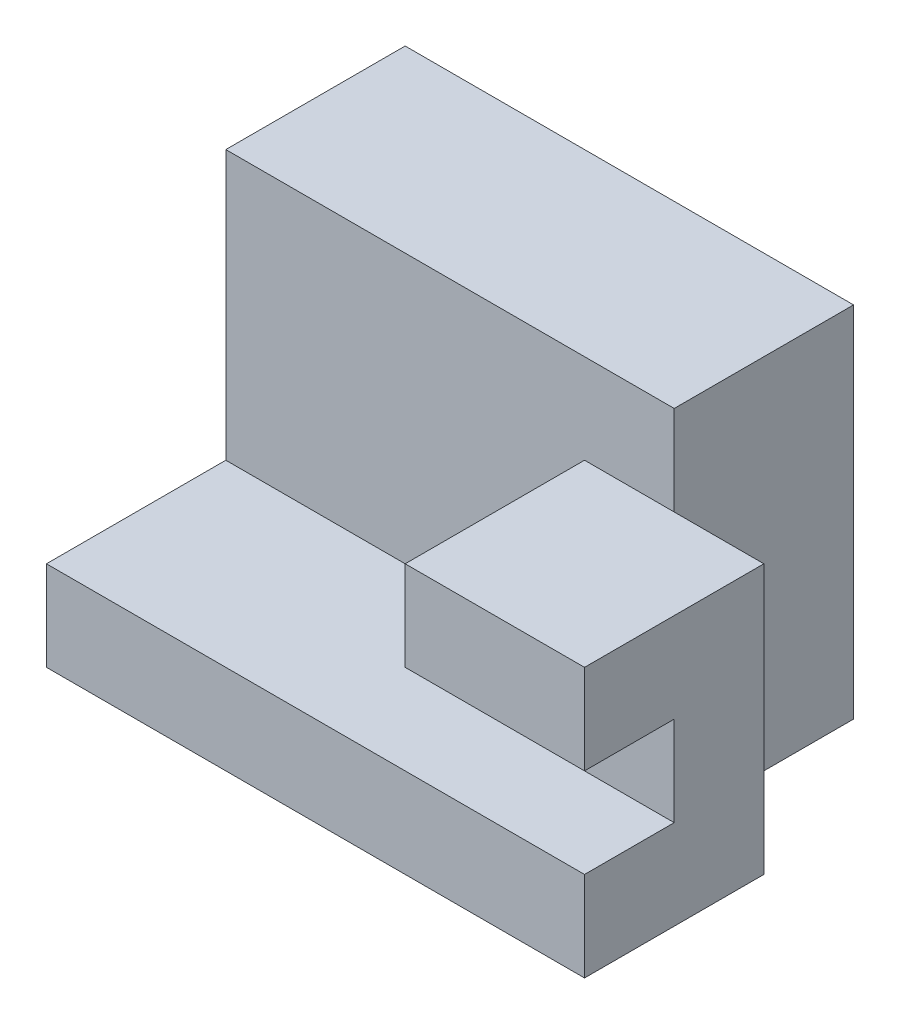
ISO-10303-21;
HEADER;
FILE_DESCRIPTION(('STEP AP214'),'2;1');
FILE_NAME('part.step','',(''),(''),'','','');
FILE_SCHEMA(('AUTOMOTIVE_DESIGN { 1 0 10303 214 1 1 1 1 }'));
ENDSEC;
DATA;
#1=APPLICATION_CONTEXT('core data for automotive mechanical design processes');
#2=APPLICATION_PROTOCOL_DEFINITION('international standard','automotive_design',2000,#1);
#3=PRODUCT_CONTEXT('',#1,'mechanical');
#4=PRODUCT('Part','Part','',(#3));
#5=PRODUCT_RELATED_PRODUCT_CATEGORY('part','',(#4));
#6=PRODUCT_DEFINITION_FORMATION('','',#4);
#7=PRODUCT_DEFINITION_CONTEXT('part definition',#1,'design');
#8=PRODUCT_DEFINITION('design','',#6,#7);
#9=PRODUCT_DEFINITION_SHAPE('','',#8);
#10=(LENGTH_UNIT() NAMED_UNIT(*) SI_UNIT(.MILLI.,.METRE.));
#11=(NAMED_UNIT(*) PLANE_ANGLE_UNIT() SI_UNIT($,.RADIAN.));
#12=(NAMED_UNIT(*) SI_UNIT($,.STERADIAN.) SOLID_ANGLE_UNIT());
#13=UNCERTAINTY_MEASURE_WITH_UNIT(LENGTH_MEASURE(1.E-05),#10,'distance_accuracy_value','');
#14=(GEOMETRIC_REPRESENTATION_CONTEXT(3) GLOBAL_UNCERTAINTY_ASSIGNED_CONTEXT((#13)) GLOBAL_UNIT_ASSIGNED_CONTEXT((#10,
#11,#12)) REPRESENTATION_CONTEXT('',''));
#15=CARTESIAN_POINT('',(0.,0.,0.));
#16=DIRECTION('',(0.,0.,1.));
#17=DIRECTION('',(1.,0.,0.));
#18=AXIS2_PLACEMENT_3D('',#15,#16,#17);
#19=CARTESIAN_POINT('',(0.,20.,0.));
#20=DIRECTION('',(0.,0.,1.));
#21=DIRECTION('',(1.,0.,0.));
#22=AXIS2_PLACEMENT_3D('',#19,#20,#21);
#23=PLANE('',#22);
#24=DIRECTION('',(0.,-1.,0.));
#25=VECTOR('',#24,1.);
#26=CARTESIAN_POINT('',(20.,0.,0.));
#27=LINE('',#26,#25);
#28=CARTESIAN_POINT('',(20.,15.,0.));
#29=VERTEX_POINT('',#28);
#30=CARTESIAN_POINT('',(20.,5.,0.));
#31=VERTEX_POINT('',#30);
#32=EDGE_CURVE('E50',#29,#31,#27,.T.);
#33=ORIENTED_EDGE('',*,*,#32,.F.);
#34=DIRECTION('',(1.,0.,0.));
#35=VECTOR('',#34,1.);
#36=CARTESIAN_POINT('',(20.,15.,0.));
#37=LINE('',#36,#35);
#38=CARTESIAN_POINT('',(25.,15.,0.));
#39=VERTEX_POINT('',#38);
#40=EDGE_CURVE('E149',#29,#39,#37,.T.);
#41=ORIENTED_EDGE('',*,*,#40,.T.);
#42=DIRECTION('',(0.,-1.,0.));
#43=VECTOR('',#42,1.);
#44=CARTESIAN_POINT('',(25.,20.,0.));
#45=LINE('',#44,#43);
#46=CARTESIAN_POINT('',(25.,20.,0.));
#47=VERTEX_POINT('',#46);
#48=EDGE_CURVE('E38',#47,#39,#45,.T.);
#49=ORIENTED_EDGE('',*,*,#48,.F.);
#50=DIRECTION('',(-1.,0.,0.));
#51=VECTOR('',#50,1.);
#52=CARTESIAN_POINT('',(0.,20.,0.));
#53=LINE('',#52,#51);
#54=CARTESIAN_POINT('',(0.,20.,0.));
#55=VERTEX_POINT('',#54);
#56=EDGE_CURVE('E202',#47,#55,#53,.T.);
#57=ORIENTED_EDGE('',*,*,#56,.T.);
#58=DIRECTION('',(0.,-1.,0.));
#59=VECTOR('',#58,1.);
#60=CARTESIAN_POINT('',(0.,20.,0.));
#61=LINE('',#60,#59);
#62=CARTESIAN_POINT('',(0.,5.,0.));
#63=VERTEX_POINT('',#62);
#64=EDGE_CURVE('E215',#55,#63,#61,.T.);
#65=ORIENTED_EDGE('',*,*,#64,.T.);
#66=DIRECTION('',(-1.,0.,0.));
#67=VECTOR('',#66,1.);
#68=CARTESIAN_POINT('',(0.,5.,0.));
#69=LINE('',#68,#67);
#70=EDGE_CURVE('E11',#31,#63,#69,.T.);
#71=ORIENTED_EDGE('',*,*,#70,.F.);
#72=EDGE_LOOP('',(#33,#41,#49,#57,#65,#71));
#73=FACE_BOUND('',#72,.T.);
#74=ADVANCED_FACE('F35',(#73),#23,.T.);
#75=CARTESIAN_POINT('',(25.,20.,0.));
#76=DIRECTION('',(1.,0.,0.));
#77=DIRECTION('',(0.,0.,-1.));
#78=AXIS2_PLACEMENT_3D('',#75,#76,#77);
#79=PLANE('',#78);
#80=DIRECTION('',(0.,0.,1.));
#81=VECTOR('',#80,1.);
#82=CARTESIAN_POINT('',(25.,0.,0.));
#83=LINE('',#82,#81);
#84=CARTESIAN_POINT('',(25.,0.,-10.));
#85=VERTEX_POINT('',#84);
#86=CARTESIAN_POINT('',(25.,0.,0.));
#87=VERTEX_POINT('',#86);
#88=EDGE_CURVE('E201',#85,#87,#83,.T.);
#89=ORIENTED_EDGE('',*,*,#88,.F.);
#90=DIRECTION('',(0.,-1.,0.));
#91=VECTOR('',#90,1.);
#92=CARTESIAN_POINT('',(25.,20.,-10.));
#93=LINE('',#92,#91);
#94=CARTESIAN_POINT('',(25.,20.,-10.));
#95=VERTEX_POINT('',#94);
#96=EDGE_CURVE('E226',#95,#85,#93,.T.);
#97=ORIENTED_EDGE('',*,*,#96,.F.);
#98=DIRECTION('',(0.,0.,1.));
#99=VECTOR('',#98,1.);
#100=CARTESIAN_POINT('',(25.,20.,0.));
#101=LINE('',#100,#99);
#102=EDGE_CURVE('E205',#95,#47,#101,.T.);
#103=ORIENTED_EDGE('',*,*,#102,.T.);
#104=ORIENTED_EDGE('',*,*,#48,.T.);
#105=EDGE_CURVE('E58',#39,#87,#45,.T.);
#106=ORIENTED_EDGE('',*,*,#105,.T.);
#107=EDGE_LOOP('',(#89,#97,#103,#104,#106));
#108=FACE_BOUND('',#107,.T.);
#109=ADVANCED_FACE('F232',(#108),#79,.T.);
#110=CARTESIAN_POINT('',(0.,20.,-10.));
#111=DIRECTION('',(0.,0.,-1.));
#112=DIRECTION('',(-1.,0.,0.));
#113=AXIS2_PLACEMENT_3D('',#110,#111,#112);
#114=PLANE('',#113);
#115=DIRECTION('',(1.,0.,0.));
#116=VECTOR('',#115,1.);
#117=CARTESIAN_POINT('',(0.,0.,-10.));
#118=LINE('',#117,#116);
#119=CARTESIAN_POINT('',(0.,0.,-10.));
#120=VERTEX_POINT('',#119);
#121=EDGE_CURVE('E218',#120,#85,#118,.T.);
#122=ORIENTED_EDGE('',*,*,#121,.F.);
#123=DIRECTION('',(0.,-1.,0.));
#124=VECTOR('',#123,1.);
#125=CARTESIAN_POINT('',(0.,20.,-10.));
#126=LINE('',#125,#124);
#127=CARTESIAN_POINT('',(0.,20.,-10.));
#128=VERTEX_POINT('',#127);
#129=EDGE_CURVE('E225',#128,#120,#126,.T.);
#130=ORIENTED_EDGE('',*,*,#129,.F.);
#131=DIRECTION('',(1.,0.,0.));
#132=VECTOR('',#131,1.);
#133=CARTESIAN_POINT('',(0.,20.,-10.));
#134=LINE('',#133,#132);
#135=EDGE_CURVE('E209',#128,#95,#134,.T.);
#136=ORIENTED_EDGE('',*,*,#135,.T.);
#137=ORIENTED_EDGE('',*,*,#96,.T.);
#138=EDGE_LOOP('',(#122,#130,#136,#137));
#139=FACE_BOUND('',#138,.T.);
#140=ADVANCED_FACE('F248',(#139),#114,.T.);
#141=CARTESIAN_POINT('',(0.,20.,0.));
#142=DIRECTION('',(-1.,0.,0.));
#143=DIRECTION('',(0.,0.,1.));
#144=AXIS2_PLACEMENT_3D('',#141,#142,#143);
#145=PLANE('',#144);
#146=DIRECTION('',(0.,0.,-1.));
#147=VECTOR('',#146,1.);
#148=CARTESIAN_POINT('',(0.,0.,0.));
#149=LINE('',#148,#147);
#150=CARTESIAN_POINT('',(0.,0.,10.));
#151=VERTEX_POINT('',#150);
#152=EDGE_CURVE('E206',#151,#120,#149,.T.);
#153=ORIENTED_EDGE('',*,*,#152,.F.);
#154=DIRECTION('',(0.,-1.,0.));
#155=VECTOR('',#154,1.);
#156=CARTESIAN_POINT('',(0.,5.,10.));
#157=LINE('',#156,#155);
#158=CARTESIAN_POINT('',(0.,5.,10.));
#159=VERTEX_POINT('',#158);
#160=EDGE_CURVE('E195',#159,#151,#157,.T.);
#161=ORIENTED_EDGE('',*,*,#160,.F.);
#162=DIRECTION('',(0.,0.,1.));
#163=VECTOR('',#162,1.);
#164=CARTESIAN_POINT('',(0.,5.,0.));
#165=LINE('',#164,#163);
#166=EDGE_CURVE('E181',#63,#159,#165,.T.);
#167=ORIENTED_EDGE('',*,*,#166,.F.);
#168=ORIENTED_EDGE('',*,*,#64,.F.);
#169=DIRECTION('',(0.,0.,-1.));
#170=VECTOR('',#169,1.);
#171=CARTESIAN_POINT('',(0.,20.,0.));
#172=LINE('',#171,#170);
#173=EDGE_CURVE('E212',#55,#128,#172,.T.);
#174=ORIENTED_EDGE('',*,*,#173,.T.);
#175=ORIENTED_EDGE('',*,*,#129,.T.);
#176=EDGE_LOOP('',(#153,#161,#167,#168,#174,#175));
#177=FACE_BOUND('',#176,.T.);
#178=ADVANCED_FACE('F250',(#177),#145,.T.);
#179=CARTESIAN_POINT('',(0.,20.,0.));
#180=DIRECTION('',(0.,1.,0.));
#181=DIRECTION('',(0.,0.,1.));
#182=AXIS2_PLACEMENT_3D('',#179,#180,#181);
#183=PLANE('',#182);
#184=ORIENTED_EDGE('',*,*,#56,.F.);
#185=ORIENTED_EDGE('',*,*,#102,.F.);
#186=ORIENTED_EDGE('',*,*,#135,.F.);
#187=ORIENTED_EDGE('',*,*,#173,.F.);
#188=EDGE_LOOP('',(#184,#185,#186,#187));
#189=FACE_BOUND('',#188,.T.);
#190=ADVANCED_FACE('F246',(#189),#183,.T.);
#191=CARTESIAN_POINT('',(0.,0.,0.));
#192=DIRECTION('',(0.,1.,0.));
#193=DIRECTION('',(0.,0.,1.));
#194=AXIS2_PLACEMENT_3D('',#191,#192,#193);
#195=PLANE('',#194);
#196=ORIENTED_EDGE('',*,*,#88,.T.);
#197=DIRECTION('',(-1.,0.,0.));
#198=VECTOR('',#197,1.);
#199=CARTESIAN_POINT('',(0.,0.,0.));
#200=LINE('',#199,#198);
#201=CARTESIAN_POINT('',(30.,0.,0.));
#202=VERTEX_POINT('',#201);
#203=EDGE_CURVE('E190',#202,#87,#200,.T.);
#204=ORIENTED_EDGE('',*,*,#203,.F.);
#205=DIRECTION('',(0.,0.,-1.));
#206=VECTOR('',#205,1.);
#207=CARTESIAN_POINT('',(30.,0.,0.));
#208=LINE('',#207,#206);
#209=CARTESIAN_POINT('',(30.,0.,10.));
#210=VERTEX_POINT('',#209);
#211=EDGE_CURVE('E175',#210,#202,#208,.T.);
#212=ORIENTED_EDGE('',*,*,#211,.F.);
#213=DIRECTION('',(1.,0.,0.));
#214=VECTOR('',#213,1.);
#215=CARTESIAN_POINT('',(0.,0.,10.));
#216=LINE('',#215,#214);
#217=EDGE_CURVE('E182',#151,#210,#216,.T.);
#218=ORIENTED_EDGE('',*,*,#217,.F.);
#219=ORIENTED_EDGE('',*,*,#152,.T.);
#220=ORIENTED_EDGE('',*,*,#121,.T.);
#221=EDGE_LOOP('',(#196,#204,#212,#218,#219,#220));
#222=FACE_BOUND('',#221,.T.);
#223=ADVANCED_FACE('F243',(#222),#195,.F.);
#224=CARTESIAN_POINT('',(30.,5.,0.));
#225=DIRECTION('',(-1.,0.,0.));
#226=DIRECTION('',(0.,0.,1.));
#227=AXIS2_PLACEMENT_3D('',#224,#225,#226);
#228=PLANE('',#227);
#229=ORIENTED_EDGE('',*,*,#211,.T.);
#230=DIRECTION('',(0.,-1.,0.));
#231=VECTOR('',#230,1.);
#232=CARTESIAN_POINT('',(30.,5.,0.));
#233=LINE('',#232,#231);
#234=CARTESIAN_POINT('',(30.,15.,0.));
#235=VERTEX_POINT('',#234);
#236=EDGE_CURVE('E198',#235,#202,#233,.T.);
#237=ORIENTED_EDGE('',*,*,#236,.F.);
#238=DIRECTION('',(0.,0.,-1.));
#239=VECTOR('',#238,1.);
#240=CARTESIAN_POINT('',(30.,15.,0.));
#241=LINE('',#240,#239);
#242=CARTESIAN_POINT('',(30.,15.,10.));
#243=VERTEX_POINT('',#242);
#244=EDGE_CURVE('E165',#243,#235,#241,.T.);
#245=ORIENTED_EDGE('',*,*,#244,.F.);
#246=DIRECTION('',(0.,1.,0.));
#247=VECTOR('',#246,1.);
#248=CARTESIAN_POINT('',(30.,0.,10.));
#249=LINE('',#248,#247);
#250=CARTESIAN_POINT('',(30.,10.,10.));
#251=VERTEX_POINT('',#250);
#252=EDGE_CURVE('E144',#251,#243,#249,.T.);
#253=ORIENTED_EDGE('',*,*,#252,.F.);
#254=DIRECTION('',(0.,0.,1.));
#255=VECTOR('',#254,1.);
#256=CARTESIAN_POINT('',(30.,10.,0.));
#257=LINE('',#256,#255);
#258=CARTESIAN_POINT('',(30.,10.,5.));
#259=VERTEX_POINT('',#258);
#260=EDGE_CURVE('E168',#259,#251,#257,.T.);
#261=ORIENTED_EDGE('',*,*,#260,.F.);
#262=DIRECTION('',(0.,-1.,0.));
#263=VECTOR('',#262,1.);
#264=CARTESIAN_POINT('',(30.,0.,5.));
#265=LINE('',#264,#263);
#266=CARTESIAN_POINT('',(30.,5.,5.));
#267=VERTEX_POINT('',#266);
#268=EDGE_CURVE('E154',#259,#267,#265,.T.);
#269=ORIENTED_EDGE('',*,*,#268,.T.);
#270=DIRECTION('',(0.,0.,-1.));
#271=VECTOR('',#270,1.);
#272=CARTESIAN_POINT('',(30.,5.,0.));
#273=LINE('',#272,#271);
#274=CARTESIAN_POINT('',(30.,5.,10.));
#275=VERTEX_POINT('',#274);
#276=EDGE_CURVE('E180',#275,#267,#273,.T.);
#277=ORIENTED_EDGE('',*,*,#276,.F.);
#278=DIRECTION('',(0.,-1.,0.));
#279=VECTOR('',#278,1.);
#280=CARTESIAN_POINT('',(30.,5.,10.));
#281=LINE('',#280,#279);
#282=EDGE_CURVE('E187',#275,#210,#281,.T.);
#283=ORIENTED_EDGE('',*,*,#282,.T.);
#284=EDGE_LOOP('',(#229,#237,#245,#253,#261,#269,#277,#283));
#285=FACE_BOUND('',#284,.T.);
#286=ADVANCED_FACE('F238',(#285),#228,.F.);
#287=CARTESIAN_POINT('',(0.,5.,0.));
#288=DIRECTION('',(0.,0.,1.));
#289=DIRECTION('',(1.,0.,0.));
#290=AXIS2_PLACEMENT_3D('',#287,#288,#289);
#291=PLANE('',#290);
#292=ORIENTED_EDGE('',*,*,#105,.F.);
#293=EDGE_CURVE('E164',#39,#235,#37,.T.);
#294=ORIENTED_EDGE('',*,*,#293,.T.);
#295=ORIENTED_EDGE('',*,*,#236,.T.);
#296=ORIENTED_EDGE('',*,*,#203,.T.);
#297=EDGE_LOOP('',(#292,#294,#295,#296));
#298=FACE_BOUND('',#297,.T.);
#299=ADVANCED_FACE('F235',(#298),#291,.F.);
#300=CARTESIAN_POINT('',(0.,5.,10.));
#301=DIRECTION('',(0.,0.,-1.));
#302=DIRECTION('',(-1.,0.,0.));
#303=AXIS2_PLACEMENT_3D('',#300,#301,#302);
#304=PLANE('',#303);
#305=ORIENTED_EDGE('',*,*,#217,.T.);
#306=ORIENTED_EDGE('',*,*,#282,.F.);
#307=DIRECTION('',(1.,0.,0.));
#308=VECTOR('',#307,1.);
#309=CARTESIAN_POINT('',(0.,5.,10.));
#310=LINE('',#309,#308);
#311=EDGE_CURVE('E185',#159,#275,#310,.T.);
#312=ORIENTED_EDGE('',*,*,#311,.F.);
#313=ORIENTED_EDGE('',*,*,#160,.T.);
#314=EDGE_LOOP('',(#305,#306,#312,#313));
#315=FACE_BOUND('',#314,.T.);
#316=ADVANCED_FACE('F272',(#315),#304,.F.);
#317=CARTESIAN_POINT('',(0.,5.,0.));
#318=DIRECTION('',(0.,1.,0.));
#319=DIRECTION('',(0.,0.,1.));
#320=AXIS2_PLACEMENT_3D('',#317,#318,#319);
#321=PLANE('',#320);
#322=DIRECTION('',(1.,0.,0.));
#323=VECTOR('',#322,1.);
#324=CARTESIAN_POINT('',(20.,5.,5.));
#325=LINE('',#324,#323);
#326=CARTESIAN_POINT('',(20.,5.,5.));
#327=VERTEX_POINT('',#326);
#328=EDGE_CURVE('E172',#327,#267,#325,.T.);
#329=ORIENTED_EDGE('',*,*,#328,.F.);
#330=DIRECTION('',(0.,0.,1.));
#331=VECTOR('',#330,1.);
#332=CARTESIAN_POINT('',(20.,5.,0.));
#333=LINE('',#332,#331);
#334=EDGE_CURVE('E161',#31,#327,#333,.T.);
#335=ORIENTED_EDGE('',*,*,#334,.F.);
#336=ORIENTED_EDGE('',*,*,#70,.T.);
#337=ORIENTED_EDGE('',*,*,#166,.T.);
#338=ORIENTED_EDGE('',*,*,#311,.T.);
#339=ORIENTED_EDGE('',*,*,#276,.T.);
#340=EDGE_LOOP('',(#329,#335,#336,#337,#338,#339));
#341=FACE_BOUND('',#340,.T.);
#342=ADVANCED_FACE('F275',(#341),#321,.T.);
#343=CARTESIAN_POINT('',(20.,0.,5.));
#344=DIRECTION('',(0.,0.,1.));
#345=DIRECTION('',(1.,0.,0.));
#346=AXIS2_PLACEMENT_3D('',#343,#344,#345);
#347=PLANE('',#346);
#348=ORIENTED_EDGE('',*,*,#268,.F.);
#349=DIRECTION('',(1.,0.,0.));
#350=VECTOR('',#349,1.);
#351=CARTESIAN_POINT('',(20.,10.,5.));
#352=LINE('',#351,#350);
#353=CARTESIAN_POINT('',(20.,10.,5.));
#354=VERTEX_POINT('',#353);
#355=EDGE_CURVE('E176',#354,#259,#352,.T.);
#356=ORIENTED_EDGE('',*,*,#355,.F.);
#357=DIRECTION('',(0.,-1.,0.));
#358=VECTOR('',#357,1.);
#359=CARTESIAN_POINT('',(20.,0.,5.));
#360=LINE('',#359,#358);
#361=EDGE_CURVE('E158',#354,#327,#360,.T.);
#362=ORIENTED_EDGE('',*,*,#361,.T.);
#363=ORIENTED_EDGE('',*,*,#328,.T.);
#364=EDGE_LOOP('',(#348,#356,#362,#363));
#365=FACE_BOUND('',#364,.T.);
#366=ADVANCED_FACE('F279',(#365),#347,.T.);
#367=CARTESIAN_POINT('',(20.,10.,0.));
#368=DIRECTION('',(0.,1.,0.));
#369=DIRECTION('',(0.,0.,1.));
#370=AXIS2_PLACEMENT_3D('',#367,#368,#369);
#371=PLANE('',#370);
#372=ORIENTED_EDGE('',*,*,#260,.T.);
#373=DIRECTION('',(1.,0.,0.));
#374=VECTOR('',#373,1.);
#375=CARTESIAN_POINT('',(20.,10.,10.));
#376=LINE('',#375,#374);
#377=CARTESIAN_POINT('',(20.,10.,10.));
#378=VERTEX_POINT('',#377);
#379=EDGE_CURVE('E148',#378,#251,#376,.T.);
#380=ORIENTED_EDGE('',*,*,#379,.F.);
#381=DIRECTION('',(0.,0.,1.));
#382=VECTOR('',#381,1.);
#383=CARTESIAN_POINT('',(20.,10.,0.));
#384=LINE('',#383,#382);
#385=EDGE_CURVE('E135',#354,#378,#384,.T.);
#386=ORIENTED_EDGE('',*,*,#385,.F.);
#387=ORIENTED_EDGE('',*,*,#355,.T.);
#388=EDGE_LOOP('',(#372,#380,#386,#387));
#389=FACE_BOUND('',#388,.T.);
#390=ADVANCED_FACE('F285',(#389),#371,.F.);
#391=CARTESIAN_POINT('',(20.,0.,10.));
#392=DIRECTION('',(0.,0.,-1.));
#393=DIRECTION('',(-1.,0.,0.));
#394=AXIS2_PLACEMENT_3D('',#391,#392,#393);
#395=PLANE('',#394);
#396=ORIENTED_EDGE('',*,*,#252,.T.);
#397=DIRECTION('',(1.,0.,0.));
#398=VECTOR('',#397,1.);
#399=CARTESIAN_POINT('',(20.,15.,10.));
#400=LINE('',#399,#398);
#401=CARTESIAN_POINT('',(20.,15.,10.));
#402=VERTEX_POINT('',#401);
#403=EDGE_CURVE('E141',#402,#243,#400,.T.);
#404=ORIENTED_EDGE('',*,*,#403,.F.);
#405=DIRECTION('',(0.,1.,0.));
#406=VECTOR('',#405,1.);
#407=CARTESIAN_POINT('',(20.,0.,10.));
#408=LINE('',#407,#406);
#409=EDGE_CURVE('E127',#378,#402,#408,.T.);
#410=ORIENTED_EDGE('',*,*,#409,.F.);
#411=ORIENTED_EDGE('',*,*,#379,.T.);
#412=EDGE_LOOP('',(#396,#404,#410,#411));
#413=FACE_BOUND('',#412,.T.);
#414=ADVANCED_FACE('F142',(#413),#395,.F.);
#415=CARTESIAN_POINT('',(20.,15.,0.));
#416=DIRECTION('',(0.,-1.,0.));
#417=DIRECTION('',(0.,0.,-1.));
#418=AXIS2_PLACEMENT_3D('',#415,#416,#417);
#419=PLANE('',#418);
#420=ORIENTED_EDGE('',*,*,#244,.T.);
#421=ORIENTED_EDGE('',*,*,#293,.F.);
#422=ORIENTED_EDGE('',*,*,#40,.F.);
#423=DIRECTION('',(0.,0.,-1.));
#424=VECTOR('',#423,1.);
#425=CARTESIAN_POINT('',(20.,15.,0.));
#426=LINE('',#425,#424);
#427=EDGE_CURVE('E131',#402,#29,#426,.T.);
#428=ORIENTED_EDGE('',*,*,#427,.F.);
#429=ORIENTED_EDGE('',*,*,#403,.T.);
#430=EDGE_LOOP('',(#420,#421,#422,#428,#429));
#431=FACE_BOUND('',#430,.T.);
#432=ADVANCED_FACE('F151',(#431),#419,.F.);
#433=CARTESIAN_POINT('',(20.,0.,0.));
#434=DIRECTION('',(1.,0.,0.));
#435=DIRECTION('',(0.,0.,-1.));
#436=AXIS2_PLACEMENT_3D('',#433,#434,#435);
#437=PLANE('',#436);
#438=ORIENTED_EDGE('',*,*,#32,.T.);
#439=ORIENTED_EDGE('',*,*,#334,.T.);
#440=ORIENTED_EDGE('',*,*,#361,.F.);
#441=ORIENTED_EDGE('',*,*,#385,.T.);
#442=ORIENTED_EDGE('',*,*,#409,.T.);
#443=ORIENTED_EDGE('',*,*,#427,.T.);
#444=EDGE_LOOP('',(#438,#439,#440,#441,#442,#443));
#445=FACE_BOUND('',#444,.T.);
#446=ADVANCED_FACE('F129',(#445),#437,.F.);
#447=CLOSED_SHELL('',(#74,#109,#140,#178,#190,#223,#286,#299,#316,#342,#366,#390,#414,#432,#446));
#448=MANIFOLD_SOLID_BREP('B2',#447);
#449=ADVANCED_BREP_SHAPE_REPRESENTATION('',(#18,#448),#14);
#450=SHAPE_DEFINITION_REPRESENTATION(#9,#449);
ENDSEC;
END-ISO-10303-21;
